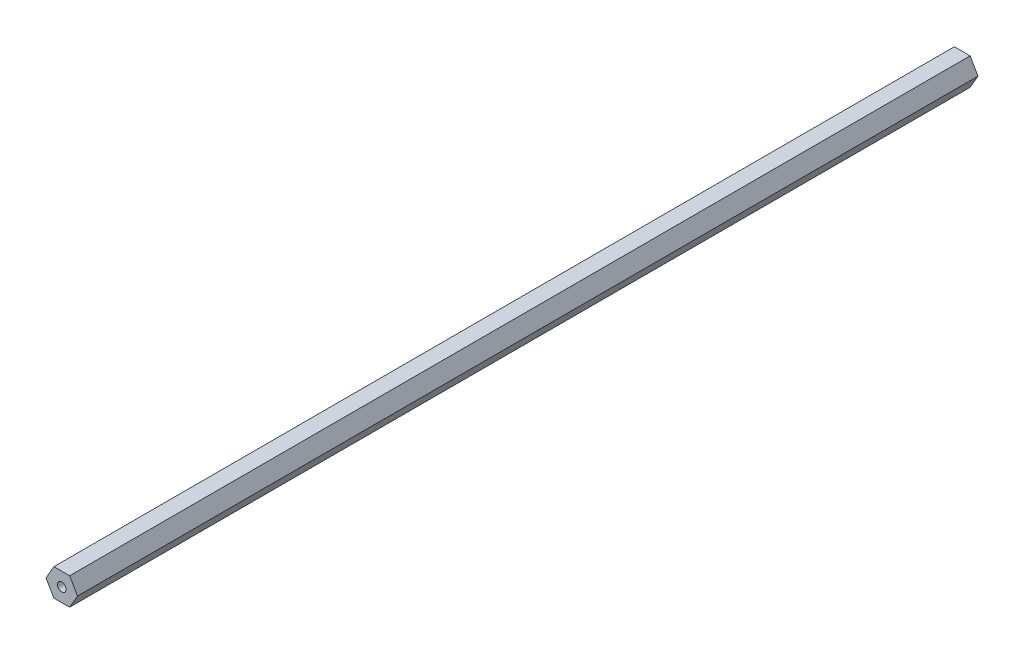
ISO-10303-21;
HEADER;
FILE_DESCRIPTION(('STEP AP214'),'2;1');
FILE_NAME('part.step','',(''),(''),'','','');
FILE_SCHEMA(('AUTOMOTIVE_DESIGN { 1 0 10303 214 1 1 1 1 }'));
ENDSEC;
DATA;
#1=APPLICATION_CONTEXT('core data for automotive mechanical design processes');
#2=APPLICATION_PROTOCOL_DEFINITION('international standard','automotive_design',2000,#1);
#3=PRODUCT_CONTEXT('',#1,'mechanical');
#4=PRODUCT('Part','Part','',(#3));
#5=PRODUCT_RELATED_PRODUCT_CATEGORY('part','',(#4));
#6=PRODUCT_DEFINITION_FORMATION('','',#4);
#7=PRODUCT_DEFINITION_CONTEXT('part definition',#1,'design');
#8=PRODUCT_DEFINITION('design','',#6,#7);
#9=PRODUCT_DEFINITION_SHAPE('','',#8);
#10=(LENGTH_UNIT() NAMED_UNIT(*) SI_UNIT(.MILLI.,.METRE.));
#11=(NAMED_UNIT(*) PLANE_ANGLE_UNIT() SI_UNIT($,.RADIAN.));
#12=(NAMED_UNIT(*) SI_UNIT($,.STERADIAN.) SOLID_ANGLE_UNIT());
#13=UNCERTAINTY_MEASURE_WITH_UNIT(LENGTH_MEASURE(1.E-05),#10,'distance_accuracy_value','');
#14=(GEOMETRIC_REPRESENTATION_CONTEXT(3) GLOBAL_UNCERTAINTY_ASSIGNED_CONTEXT((#13)) GLOBAL_UNIT_ASSIGNED_CONTEXT((#10,
#11,#12)) REPRESENTATION_CONTEXT('',''));
#15=CARTESIAN_POINT('',(0.,0.,0.));
#16=DIRECTION('',(0.,0.,1.));
#17=DIRECTION('',(1.,0.,0.));
#18=AXIS2_PLACEMENT_3D('',#15,#16,#17);
#19=CARTESIAN_POINT('',(38.3448822639292,0.00465053802825576,-419.1));
#20=DIRECTION('',(0.,0.,1.));
#21=DIRECTION('',(1.,0.,0.));
#22=AXIS2_PLACEMENT_3D('',#19,#20,#21);
#23=PLANE('',#22);
#24=CARTESIAN_POINT('',(38.3448822639292,0.00465053802825777,-419.1));
#25=DIRECTION('',(0.,0.,1.));
#26=DIRECTION('',(-1.,0.,0.));
#27=AXIS2_PLACEMENT_3D('',#24,#25,#26);
#28=CIRCLE('',#27,2.0193);
#29=CARTESIAN_POINT('',(40.3641822639292,0.004650538028258,-419.1));
#30=VERTEX_POINT('',#29);
#31=EDGE_CURVE('E233',#30,#30,#28,.T.);
#32=ORIENTED_EDGE('',*,*,#31,.T.);
#33=EDGE_LOOP('',(#32));
#34=FACE_BOUND('',#33,.T.);
#35=DIRECTION('',(0.5,0.866025403784439,0.));
#36=VECTOR('',#35,1.);
#37=CARTESIAN_POINT('',(34.678708054575,6.35465053802824,-419.1));
#38=LINE('',#37,#36);
#39=CARTESIAN_POINT('',(31.0125338452207,0.00465053802825467,-419.1));
#40=VERTEX_POINT('',#39);
#41=CARTESIAN_POINT('',(34.678708054575,6.35465053802824,-419.1));
#42=VERTEX_POINT('',#41);
#43=EDGE_CURVE('E11',#40,#42,#38,.T.);
#44=ORIENTED_EDGE('',*,*,#43,.T.);
#45=DIRECTION('',(1.,0.,0.));
#46=VECTOR('',#45,1.);
#47=CARTESIAN_POINT('',(42.0110564732832,6.35465053802827,-419.1));
#48=LINE('',#47,#46);
#49=CARTESIAN_POINT('',(42.0110564732832,6.35465053802827,-419.1));
#50=VERTEX_POINT('',#49);
#51=EDGE_CURVE('E163',#42,#50,#48,.T.);
#52=ORIENTED_EDGE('',*,*,#51,.T.);
#53=DIRECTION('',(0.5,-0.866025403784438,0.));
#54=VECTOR('',#53,1.);
#55=CARTESIAN_POINT('',(45.6772306826374,0.00465053802825909,-419.1));
#56=LINE('',#55,#54);
#57=CARTESIAN_POINT('',(45.6772306826374,0.00465053802825909,-419.1));
#58=VERTEX_POINT('',#57);
#59=EDGE_CURVE('E68',#50,#58,#56,.T.);
#60=ORIENTED_EDGE('',*,*,#59,.T.);
#61=DIRECTION('',(-0.5,-0.866025403784439,0.));
#62=VECTOR('',#61,1.);
#63=CARTESIAN_POINT('',(42.0110564732832,-6.34534946197173,-419.1));
#64=LINE('',#63,#62);
#65=CARTESIAN_POINT('',(42.0110564732832,-6.34534946197173,-419.1));
#66=VERTEX_POINT('',#65);
#67=EDGE_CURVE('E153',#58,#66,#64,.T.);
#68=ORIENTED_EDGE('',*,*,#67,.T.);
#69=DIRECTION('',(-1.,0.,0.));
#70=VECTOR('',#69,1.);
#71=CARTESIAN_POINT('',(34.678708054575,-6.34534946197176,-419.1));
#72=LINE('',#71,#70);
#73=CARTESIAN_POINT('',(34.678708054575,-6.34534946197176,-419.1));
#74=VERTEX_POINT('',#73);
#75=EDGE_CURVE('E114',#66,#74,#72,.T.);
#76=ORIENTED_EDGE('',*,*,#75,.T.);
#77=DIRECTION('',(-0.5,0.866025403784439,0.));
#78=VECTOR('',#77,1.);
#79=CARTESIAN_POINT('',(31.0125338452207,0.00465053802825467,-419.1));
#80=LINE('',#79,#78);
#81=EDGE_CURVE('E121',#74,#40,#80,.T.);
#82=ORIENTED_EDGE('',*,*,#81,.T.);
#83=EDGE_LOOP('',(#44,#52,#60,#68,#76,#82));
#84=FACE_BOUND('',#83,.T.);
#85=ADVANCED_FACE('F17',(#34,#84),#23,.F.);
#86=CARTESIAN_POINT('',(38.3448822639292,0.00465053802825576,0.));
#87=DIRECTION('',(0.,0.,1.));
#88=DIRECTION('',(1.,0.,0.));
#89=AXIS2_PLACEMENT_3D('',#86,#87,#88);
#90=PLANE('',#89);
#91=CARTESIAN_POINT('',(38.3448822639292,0.00465053802825777,0.));
#92=DIRECTION('',(0.,0.,-1.));
#93=DIRECTION('',(-1.,0.,0.));
#94=AXIS2_PLACEMENT_3D('',#91,#92,#93);
#95=CIRCLE('',#94,2.0193);
#96=CARTESIAN_POINT('',(40.3641822639292,0.00465053802825802,0.));
#97=VERTEX_POINT('',#96);
#98=EDGE_CURVE('E127',#97,#97,#95,.T.);
#99=ORIENTED_EDGE('',*,*,#98,.T.);
#100=EDGE_LOOP('',(#99));
#101=FACE_BOUND('',#100,.T.);
#102=DIRECTION('',(-0.5,-0.866025403784439,0.));
#103=VECTOR('',#102,1.);
#104=CARTESIAN_POINT('',(34.678708054575,6.35465053802824,0.));
#105=LINE('',#104,#103);
#106=CARTESIAN_POINT('',(34.678708054575,6.35465053802824,0.));
#107=VERTEX_POINT('',#106);
#108=CARTESIAN_POINT('',(31.0125338452207,0.00465053802825467,0.));
#109=VERTEX_POINT('',#108);
#110=EDGE_CURVE('E26',#107,#109,#105,.T.);
#111=ORIENTED_EDGE('',*,*,#110,.T.);
#112=DIRECTION('',(0.5,-0.866025403784439,0.));
#113=VECTOR('',#112,1.);
#114=CARTESIAN_POINT('',(31.0125338452207,0.00465053802825467,0.));
#115=LINE('',#114,#113);
#116=CARTESIAN_POINT('',(34.678708054575,-6.34534946197176,0.));
#117=VERTEX_POINT('',#116);
#118=EDGE_CURVE('E120',#109,#117,#115,.T.);
#119=ORIENTED_EDGE('',*,*,#118,.T.);
#120=DIRECTION('',(1.,0.,0.));
#121=VECTOR('',#120,1.);
#122=CARTESIAN_POINT('',(34.678708054575,-6.34534946197176,0.));
#123=LINE('',#122,#121);
#124=CARTESIAN_POINT('',(42.0110564732832,-6.34534946197173,0.));
#125=VERTEX_POINT('',#124);
#126=EDGE_CURVE('E104',#117,#125,#123,.T.);
#127=ORIENTED_EDGE('',*,*,#126,.T.);
#128=DIRECTION('',(0.5,0.866025403784439,0.));
#129=VECTOR('',#128,1.);
#130=CARTESIAN_POINT('',(42.0110564732832,-6.34534946197173,0.));
#131=LINE('',#130,#129);
#132=CARTESIAN_POINT('',(45.6772306826374,0.00465053802825909,0.));
#133=VERTEX_POINT('',#132);
#134=EDGE_CURVE('E146',#125,#133,#131,.T.);
#135=ORIENTED_EDGE('',*,*,#134,.T.);
#136=DIRECTION('',(-0.5,0.866025403784438,0.));
#137=VECTOR('',#136,1.);
#138=CARTESIAN_POINT('',(45.6772306826374,0.00465053802825909,0.));
#139=LINE('',#138,#137);
#140=CARTESIAN_POINT('',(42.0110564732832,6.35465053802827,0.));
#141=VERTEX_POINT('',#140);
#142=EDGE_CURVE('E143',#133,#141,#139,.T.);
#143=ORIENTED_EDGE('',*,*,#142,.T.);
#144=DIRECTION('',(-1.,0.,0.));
#145=VECTOR('',#144,1.);
#146=CARTESIAN_POINT('',(42.0110564732832,6.35465053802827,0.));
#147=LINE('',#146,#145);
#148=EDGE_CURVE('E80',#141,#107,#147,.T.);
#149=ORIENTED_EDGE('',*,*,#148,.T.);
#150=EDGE_LOOP('',(#111,#119,#127,#135,#143,#149));
#151=FACE_BOUND('',#150,.T.);
#152=ADVANCED_FACE('F124',(#101,#151),#90,.T.);
#153=CARTESIAN_POINT('',(31.0125338452207,0.00465053802825467,0.));
#154=DIRECTION('',(-0.866025403784439,0.5,0.));
#155=DIRECTION('',(0.,0.,1.));
#156=AXIS2_PLACEMENT_3D('',#153,#154,#155);
#157=PLANE('',#156);
#158=ORIENTED_EDGE('',*,*,#110,.F.);
#159=DIRECTION('',(0.,0.,-1.));
#160=VECTOR('',#159,1.);
#161=CARTESIAN_POINT('',(34.678708054575,6.35465053802824,0.));
#162=LINE('',#161,#160);
#163=EDGE_CURVE('E166',#107,#42,#162,.T.);
#164=ORIENTED_EDGE('',*,*,#163,.T.);
#165=ORIENTED_EDGE('',*,*,#43,.F.);
#166=DIRECTION('',(0.,0.,-1.));
#167=VECTOR('',#166,1.);
#168=CARTESIAN_POINT('',(31.0125338452207,0.00465053802825467,0.));
#169=LINE('',#168,#167);
#170=EDGE_CURVE('E126',#109,#40,#169,.T.);
#171=ORIENTED_EDGE('',*,*,#170,.F.);
#172=EDGE_LOOP('',(#158,#164,#165,#171));
#173=FACE_BOUND('',#172,.T.);
#174=ADVANCED_FACE('F248',(#173),#157,.T.);
#175=CARTESIAN_POINT('',(34.678708054575,6.35465053802824,0.));
#176=DIRECTION('',(0.,1.,0.));
#177=DIRECTION('',(1.,0.,0.));
#178=AXIS2_PLACEMENT_3D('',#175,#176,#177);
#179=PLANE('',#178);
#180=ORIENTED_EDGE('',*,*,#148,.F.);
#181=DIRECTION('',(0.,0.,-1.));
#182=VECTOR('',#181,1.);
#183=CARTESIAN_POINT('',(42.0110564732832,6.35465053802827,0.));
#184=LINE('',#183,#182);
#185=EDGE_CURVE('E142',#141,#50,#184,.T.);
#186=ORIENTED_EDGE('',*,*,#185,.T.);
#187=ORIENTED_EDGE('',*,*,#51,.F.);
#188=ORIENTED_EDGE('',*,*,#163,.F.);
#189=EDGE_LOOP('',(#180,#186,#187,#188));
#190=FACE_BOUND('',#189,.T.);
#191=ADVANCED_FACE('F256',(#190),#179,.T.);
#192=CARTESIAN_POINT('',(42.0110564732832,6.35465053802827,0.));
#193=DIRECTION('',(0.866025403784438,0.5,0.));
#194=DIRECTION('',(0.,0.,-1.));
#195=AXIS2_PLACEMENT_3D('',#192,#193,#194);
#196=PLANE('',#195);
#197=ORIENTED_EDGE('',*,*,#142,.F.);
#198=DIRECTION('',(0.,0.,-1.));
#199=VECTOR('',#198,1.);
#200=CARTESIAN_POINT('',(45.6772306826374,0.00465053802825909,0.));
#201=LINE('',#200,#199);
#202=EDGE_CURVE('E138',#133,#58,#201,.T.);
#203=ORIENTED_EDGE('',*,*,#202,.T.);
#204=ORIENTED_EDGE('',*,*,#59,.F.);
#205=ORIENTED_EDGE('',*,*,#185,.F.);
#206=EDGE_LOOP('',(#197,#203,#204,#205));
#207=FACE_BOUND('',#206,.T.);
#208=ADVANCED_FACE('F261',(#207),#196,.T.);
#209=CARTESIAN_POINT('',(45.6772306826374,0.00465053802825909,0.));
#210=DIRECTION('',(0.866025403784439,-0.5,0.));
#211=DIRECTION('',(0.,0.,-1.));
#212=AXIS2_PLACEMENT_3D('',#209,#210,#211);
#213=PLANE('',#212);
#214=ORIENTED_EDGE('',*,*,#134,.F.);
#215=DIRECTION('',(0.,0.,-1.));
#216=VECTOR('',#215,1.);
#217=CARTESIAN_POINT('',(42.0110564732832,-6.34534946197173,0.));
#218=LINE('',#217,#216);
#219=EDGE_CURVE('E111',#125,#66,#218,.T.);
#220=ORIENTED_EDGE('',*,*,#219,.T.);
#221=ORIENTED_EDGE('',*,*,#67,.F.);
#222=ORIENTED_EDGE('',*,*,#202,.F.);
#223=EDGE_LOOP('',(#214,#220,#221,#222));
#224=FACE_BOUND('',#223,.T.);
#225=ADVANCED_FACE('F264',(#224),#213,.T.);
#226=CARTESIAN_POINT('',(42.0110564732832,-6.34534946197173,0.));
#227=DIRECTION('',(0.,-1.,0.));
#228=DIRECTION('',(0.,0.,-1.));
#229=AXIS2_PLACEMENT_3D('',#226,#227,#228);
#230=PLANE('',#229);
#231=ORIENTED_EDGE('',*,*,#126,.F.);
#232=DIRECTION('',(0.,0.,-1.));
#233=VECTOR('',#232,1.);
#234=CARTESIAN_POINT('',(34.678708054575,-6.34534946197176,0.));
#235=LINE('',#234,#233);
#236=EDGE_CURVE('E108',#117,#74,#235,.T.);
#237=ORIENTED_EDGE('',*,*,#236,.T.);
#238=ORIENTED_EDGE('',*,*,#75,.F.);
#239=ORIENTED_EDGE('',*,*,#219,.F.);
#240=EDGE_LOOP('',(#231,#237,#238,#239));
#241=FACE_BOUND('',#240,.T.);
#242=ADVANCED_FACE('F106',(#241),#230,.T.);
#243=CARTESIAN_POINT('',(34.678708054575,-6.34534946197176,0.));
#244=DIRECTION('',(-0.866025403784439,-0.5,0.));
#245=DIRECTION('',(-0.5,0.866025403784439,0.));
#246=AXIS2_PLACEMENT_3D('',#243,#244,#245);
#247=PLANE('',#246);
#248=ORIENTED_EDGE('',*,*,#118,.F.);
#249=ORIENTED_EDGE('',*,*,#170,.T.);
#250=ORIENTED_EDGE('',*,*,#81,.F.);
#251=ORIENTED_EDGE('',*,*,#236,.F.);
#252=EDGE_LOOP('',(#248,#249,#250,#251));
#253=FACE_BOUND('',#252,.T.);
#254=ADVANCED_FACE('F118',(#253),#247,.T.);
#255=CARTESIAN_POINT('',(38.3448822639292,0.00465053802825777,0.));
#256=DIRECTION('',(0.,0.,-1.));
#257=DIRECTION('',(-1.,0.,0.));
#258=AXIS2_PLACEMENT_3D('',#255,#256,#257);
#259=CYLINDRICAL_SURFACE('',#258,2.0193);
#260=ORIENTED_EDGE('',*,*,#31,.F.);
#261=DIRECTION('',(0.,0.,1.));
#262=VECTOR('',#261,1.);
#263=CARTESIAN_POINT('',(40.3641822639292,0.00465053802825751,0.));
#264=LINE('',#263,#262);
#265=EDGE_CURVE('E135',#30,#97,#264,.T.);
#266=ORIENTED_EDGE('',*,*,#265,.T.);
#267=ORIENTED_EDGE('',*,*,#98,.F.);
#268=ORIENTED_EDGE('',*,*,#265,.F.);
#269=EDGE_LOOP('',(#260,#266,#267,#268));
#270=FACE_BOUND('',#269,.T.);
#271=ADVANCED_FACE('F244',(#270),#259,.F.);
#272=CLOSED_SHELL('',(#85,#152,#174,#191,#208,#225,#242,#254,#271));
#273=MANIFOLD_SOLID_BREP('B1',#272);
#274=ADVANCED_BREP_SHAPE_REPRESENTATION('',(#18,#273),#14);
#275=SHAPE_DEFINITION_REPRESENTATION(#9,#274);
ENDSEC;
END-ISO-10303-21;
